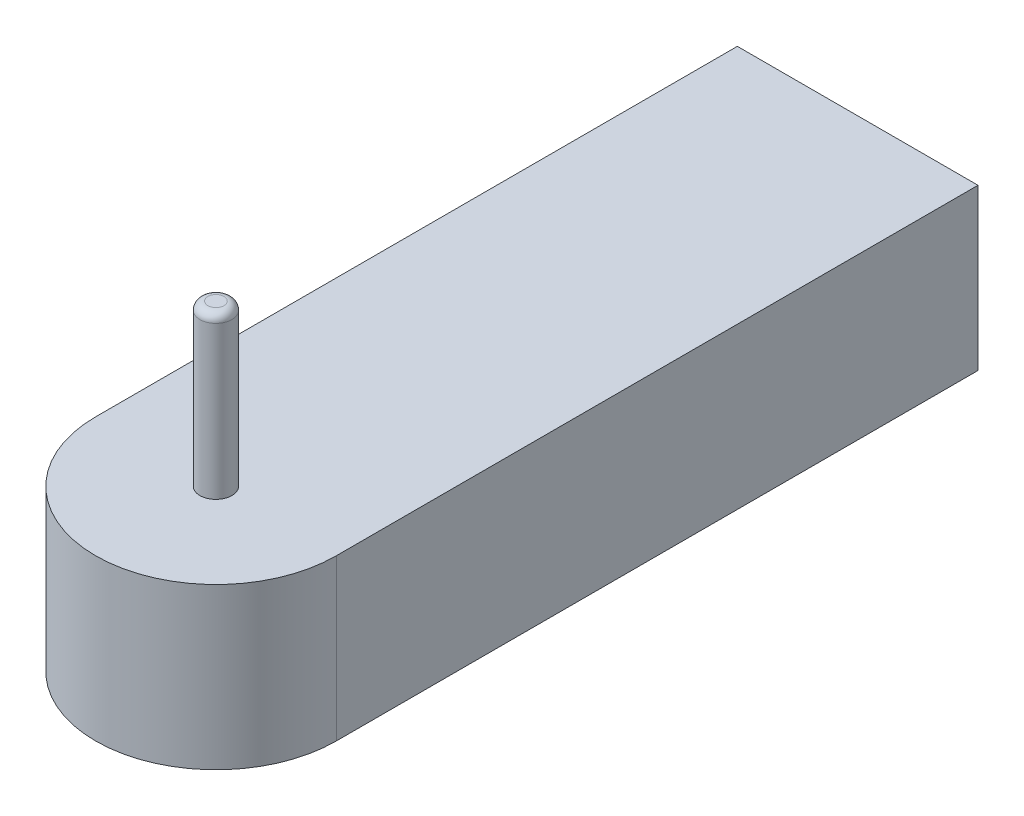
ISO-10303-21;
HEADER;
FILE_DESCRIPTION(('STEP AP214'),'2;1');
FILE_NAME('part.step','',(''),(''),'','','');
FILE_SCHEMA(('AUTOMOTIVE_DESIGN { 1 0 10303 214 1 1 1 1 }'));
ENDSEC;
DATA;
#1=APPLICATION_CONTEXT('core data for automotive mechanical design processes');
#2=APPLICATION_PROTOCOL_DEFINITION('international standard','automotive_design',2000,#1);
#3=PRODUCT_CONTEXT('',#1,'mechanical');
#4=PRODUCT('Part','Part','',(#3));
#5=PRODUCT_RELATED_PRODUCT_CATEGORY('part','',(#4));
#6=PRODUCT_DEFINITION_FORMATION('','',#4);
#7=PRODUCT_DEFINITION_CONTEXT('part definition',#1,'design');
#8=PRODUCT_DEFINITION('design','',#6,#7);
#9=PRODUCT_DEFINITION_SHAPE('','',#8);
#10=(LENGTH_UNIT() NAMED_UNIT(*) SI_UNIT(.MILLI.,.METRE.));
#11=(NAMED_UNIT(*) PLANE_ANGLE_UNIT() SI_UNIT($,.RADIAN.));
#12=(NAMED_UNIT(*) SI_UNIT($,.STERADIAN.) SOLID_ANGLE_UNIT());
#13=UNCERTAINTY_MEASURE_WITH_UNIT(LENGTH_MEASURE(1.E-05),#10,'distance_accuracy_value','');
#14=(GEOMETRIC_REPRESENTATION_CONTEXT(3) GLOBAL_UNCERTAINTY_ASSIGNED_CONTEXT((#13)) GLOBAL_UNIT_ASSIGNED_CONTEXT((#10,
#11,#12)) REPRESENTATION_CONTEXT('',''));
#15=CARTESIAN_POINT('',(0.,0.,0.));
#16=DIRECTION('',(0.,0.,1.));
#17=DIRECTION('',(1.,0.,0.));
#18=AXIS2_PLACEMENT_3D('',#15,#16,#17);
#19=CARTESIAN_POINT('',(75.0000000000001,100.,400.));
#20=DIRECTION('',(0.,1.,0.));
#21=DIRECTION('',(0.,0.,1.));
#22=AXIS2_PLACEMENT_3D('',#19,#20,#21);
#23=PLANE('',#22);
#24=DIRECTION('',(0.,0.,1.));
#25=VECTOR('',#24,1.);
#26=CARTESIAN_POINT('',(0.,100.,0.));
#27=LINE('',#26,#25);
#28=CARTESIAN_POINT('',(0.,100.,0.));
#29=VERTEX_POINT('',#28);
#30=CARTESIAN_POINT('',(0.,100.,400.));
#31=VERTEX_POINT('',#30);
#32=EDGE_CURVE('E90',#29,#31,#27,.T.);
#33=ORIENTED_EDGE('',*,*,#32,.T.);
#34=CARTESIAN_POINT('',(75.0000000000001,100.,400.));
#35=DIRECTION('',(0.,1.,0.));
#36=DIRECTION('',(0.,0.,1.));
#37=AXIS2_PLACEMENT_3D('',#34,#35,#36);
#38=CIRCLE('',#37,75.);
#39=CARTESIAN_POINT('',(150.,100.,400.));
#40=VERTEX_POINT('',#39);
#41=EDGE_CURVE('E85',#31,#40,#38,.T.);
#42=ORIENTED_EDGE('',*,*,#41,.T.);
#43=DIRECTION('',(0.,0.,-1.));
#44=VECTOR('',#43,1.);
#45=CARTESIAN_POINT('',(150.,100.,0.));
#46=LINE('',#45,#44);
#47=CARTESIAN_POINT('',(150.,100.,0.));
#48=VERTEX_POINT('',#47);
#49=EDGE_CURVE('E88',#40,#48,#46,.T.);
#50=ORIENTED_EDGE('',*,*,#49,.T.);
#51=DIRECTION('',(-1.,0.,0.));
#52=VECTOR('',#51,1.);
#53=CARTESIAN_POINT('',(0.,100.,0.));
#54=LINE('',#53,#52);
#55=EDGE_CURVE('E54',#48,#29,#54,.T.);
#56=ORIENTED_EDGE('',*,*,#55,.T.);
#57=EDGE_LOOP('',(#33,#42,#50,#56));
#58=FACE_BOUND('',#57,.T.);
#59=CARTESIAN_POINT('',(75.0000000000001,100.,400.));
#60=DIRECTION('',(0.,1.,0.));
#61=DIRECTION('',(0.,0.,1.));
#62=AXIS2_PLACEMENT_3D('',#59,#60,#61);
#63=CIRCLE('',#62,10.);
#64=CARTESIAN_POINT('',(75.0000000000001,100.,410.));
#65=VERTEX_POINT('',#64);
#66=EDGE_CURVE('E108',#65,#65,#63,.T.);
#67=ORIENTED_EDGE('',*,*,#66,.F.);
#68=EDGE_LOOP('',(#67));
#69=FACE_BOUND('',#68,.T.);
#70=ADVANCED_FACE('F37',(#58,#69),#23,.T.);
#71=CARTESIAN_POINT('',(0.,100.,0.));
#72=DIRECTION('',(1.,0.,0.));
#73=DIRECTION('',(0.,0.,-1.));
#74=AXIS2_PLACEMENT_3D('',#71,#72,#73);
#75=PLANE('',#74);
#76=DIRECTION('',(0.,0.,1.));
#77=VECTOR('',#76,1.);
#78=CARTESIAN_POINT('',(0.,0.,0.));
#79=LINE('',#78,#77);
#80=CARTESIAN_POINT('',(0.,0.,0.));
#81=VERTEX_POINT('',#80);
#82=CARTESIAN_POINT('',(0.,0.,400.));
#83=VERTEX_POINT('',#82);
#84=EDGE_CURVE('E105',#81,#83,#79,.T.);
#85=ORIENTED_EDGE('',*,*,#84,.T.);
#86=DIRECTION('',(0.,-1.,0.));
#87=VECTOR('',#86,1.);
#88=CARTESIAN_POINT('',(0.,100.,400.));
#89=LINE('',#88,#87);
#90=EDGE_CURVE('E96',#31,#83,#89,.T.);
#91=ORIENTED_EDGE('',*,*,#90,.F.);
#92=ORIENTED_EDGE('',*,*,#32,.F.);
#93=DIRECTION('',(0.,-1.,0.));
#94=VECTOR('',#93,1.);
#95=CARTESIAN_POINT('',(0.,100.,0.));
#96=LINE('',#95,#94);
#97=EDGE_CURVE('E101',#29,#81,#96,.T.);
#98=ORIENTED_EDGE('',*,*,#97,.T.);
#99=EDGE_LOOP('',(#85,#91,#92,#98));
#100=FACE_BOUND('',#99,.T.);
#101=ADVANCED_FACE('F128',(#100),#75,.F.);
#102=CARTESIAN_POINT('',(75.0000000000001,100.,400.));
#103=DIRECTION('',(0.,-1.,0.));
#104=DIRECTION('',(0.,0.,-1.));
#105=AXIS2_PLACEMENT_3D('',#102,#103,#104);
#106=CYLINDRICAL_SURFACE('',#105,75.);
#107=CARTESIAN_POINT('',(75.0000000000001,0.,400.));
#108=DIRECTION('',(0.,1.,0.));
#109=DIRECTION('',(0.,0.,1.));
#110=AXIS2_PLACEMENT_3D('',#107,#108,#109);
#111=CIRCLE('',#110,75.);
#112=CARTESIAN_POINT('',(150.,0.,400.));
#113=VERTEX_POINT('',#112);
#114=EDGE_CURVE('E95',#83,#113,#111,.T.);
#115=ORIENTED_EDGE('',*,*,#114,.T.);
#116=DIRECTION('',(0.,-1.,0.));
#117=VECTOR('',#116,1.);
#118=CARTESIAN_POINT('',(150.,100.,400.));
#119=LINE('',#118,#117);
#120=EDGE_CURVE('E93',#40,#113,#119,.T.);
#121=ORIENTED_EDGE('',*,*,#120,.F.);
#122=ORIENTED_EDGE('',*,*,#41,.F.);
#123=ORIENTED_EDGE('',*,*,#90,.T.);
#124=EDGE_LOOP('',(#115,#121,#122,#123));
#125=FACE_BOUND('',#124,.T.);
#126=ADVANCED_FACE('F94',(#125),#106,.T.);
#127=CARTESIAN_POINT('',(150.,100.,0.));
#128=DIRECTION('',(-1.,0.,0.));
#129=DIRECTION('',(0.,0.,1.));
#130=AXIS2_PLACEMENT_3D('',#127,#128,#129);
#131=PLANE('',#130);
#132=DIRECTION('',(0.,0.,-1.));
#133=VECTOR('',#132,1.);
#134=CARTESIAN_POINT('',(150.,0.,0.));
#135=LINE('',#134,#133);
#136=CARTESIAN_POINT('',(150.,0.,0.));
#137=VERTEX_POINT('',#136);
#138=EDGE_CURVE('E71',#113,#137,#135,.T.);
#139=ORIENTED_EDGE('',*,*,#138,.T.);
#140=DIRECTION('',(0.,-1.,0.));
#141=VECTOR('',#140,1.);
#142=CARTESIAN_POINT('',(150.,100.,0.));
#143=LINE('',#142,#141);
#144=EDGE_CURVE('E97',#48,#137,#143,.T.);
#145=ORIENTED_EDGE('',*,*,#144,.F.);
#146=ORIENTED_EDGE('',*,*,#49,.F.);
#147=ORIENTED_EDGE('',*,*,#120,.T.);
#148=EDGE_LOOP('',(#139,#145,#146,#147));
#149=FACE_BOUND('',#148,.T.);
#150=ADVANCED_FACE('F99',(#149),#131,.F.);
#151=CARTESIAN_POINT('',(0.,100.,0.));
#152=DIRECTION('',(0.,0.,1.));
#153=DIRECTION('',(1.,0.,0.));
#154=AXIS2_PLACEMENT_3D('',#151,#152,#153);
#155=PLANE('',#154);
#156=DIRECTION('',(-1.,0.,0.));
#157=VECTOR('',#156,1.);
#158=CARTESIAN_POINT('',(0.,0.,0.));
#159=LINE('',#158,#157);
#160=EDGE_CURVE('E77',#137,#81,#159,.T.);
#161=ORIENTED_EDGE('',*,*,#160,.T.);
#162=ORIENTED_EDGE('',*,*,#97,.F.);
#163=ORIENTED_EDGE('',*,*,#55,.F.);
#164=ORIENTED_EDGE('',*,*,#144,.T.);
#165=EDGE_LOOP('',(#161,#162,#163,#164));
#166=FACE_BOUND('',#165,.T.);
#167=ADVANCED_FACE('F139',(#166),#155,.F.);
#168=CARTESIAN_POINT('',(75.0000000000001,0.,400.));
#169=DIRECTION('',(0.,1.,0.));
#170=DIRECTION('',(0.,0.,1.));
#171=AXIS2_PLACEMENT_3D('',#168,#169,#170);
#172=PLANE('',#171);
#173=ORIENTED_EDGE('',*,*,#84,.F.);
#174=ORIENTED_EDGE('',*,*,#160,.F.);
#175=ORIENTED_EDGE('',*,*,#138,.F.);
#176=ORIENTED_EDGE('',*,*,#114,.F.);
#177=EDGE_LOOP('',(#173,#174,#175,#176));
#178=FACE_BOUND('',#177,.T.);
#179=ADVANCED_FACE('F136',(#178),#172,.F.);
#180=CARTESIAN_POINT('',(75.0000000000001,200.,400.));
#181=DIRECTION('',(0.,-1.,0.));
#182=DIRECTION('',(0.,0.,-1.));
#183=AXIS2_PLACEMENT_3D('',#180,#181,#182);
#184=CYLINDRICAL_SURFACE('',#183,10.);
#185=CARTESIAN_POINT('',(75.0000000000001,195.,400.));
#186=DIRECTION('',(0.,1.,0.));
#187=DIRECTION('',(0.,0.,1.));
#188=AXIS2_PLACEMENT_3D('',#185,#186,#187);
#189=CIRCLE('',#188,10.);
#190=CARTESIAN_POINT('',(75.0000000000001,195.,410.));
#191=VERTEX_POINT('',#190);
#192=EDGE_CURVE('E11',#191,#191,#189,.F.);
#193=ORIENTED_EDGE('',*,*,#192,.T.);
#194=EDGE_LOOP('',(#193));
#195=FACE_BOUND('',#194,.T.);
#196=ORIENTED_EDGE('',*,*,#66,.T.);
#197=EDGE_LOOP('',(#196));
#198=FACE_BOUND('',#197,.T.);
#199=ADVANCED_FACE('F124',(#195,#198),#184,.T.);
#200=CARTESIAN_POINT('',(75.0000000000001,200.,400.));
#201=DIRECTION('',(0.,1.,0.));
#202=DIRECTION('',(0.,0.,1.));
#203=AXIS2_PLACEMENT_3D('',#200,#201,#202);
#204=PLANE('',#203);
#205=CARTESIAN_POINT('',(75.0000000000001,200.,400.));
#206=DIRECTION('',(0.,1.,0.));
#207=DIRECTION('',(0.,0.,1.));
#208=AXIS2_PLACEMENT_3D('',#205,#206,#207);
#209=CIRCLE('',#208,5.);
#210=CARTESIAN_POINT('',(75.0000000000001,200.,405.));
#211=VERTEX_POINT('',#210);
#212=EDGE_CURVE('E46',#211,#211,#209,.T.);
#213=ORIENTED_EDGE('',*,*,#212,.T.);
#214=EDGE_LOOP('',(#213));
#215=FACE_BOUND('',#214,.T.);
#216=ADVANCED_FACE('F117',(#215),#204,.T.);
#217=CARTESIAN_POINT('',(75.0000000000001,195.,400.));
#218=DIRECTION('',(0.,1.,0.));
#219=DIRECTION('',(0.,0.,1.));
#220=AXIS2_PLACEMENT_3D('',#217,#218,#219);
#221=DEGENERATE_TOROIDAL_SURFACE('',#220,5.,5.,.T.);
#222=ORIENTED_EDGE('',*,*,#192,.F.);
#223=EDGE_LOOP('',(#222));
#224=FACE_BOUND('',#223,.T.);
#225=ORIENTED_EDGE('',*,*,#212,.F.);
#226=EDGE_LOOP('',(#225));
#227=FACE_BOUND('',#226,.T.);
#228=ADVANCED_FACE('F39',(#224,#227),#221,.T.);
#229=CLOSED_SHELL('',(#70,#101,#126,#150,#167,#179,#199,#216,#228));
#230=MANIFOLD_SOLID_BREP('B2',#229);
#231=ADVANCED_BREP_SHAPE_REPRESENTATION('',(#18,#230),#14);
#232=SHAPE_DEFINITION_REPRESENTATION(#9,#231);
ENDSEC;
END-ISO-10303-21;
